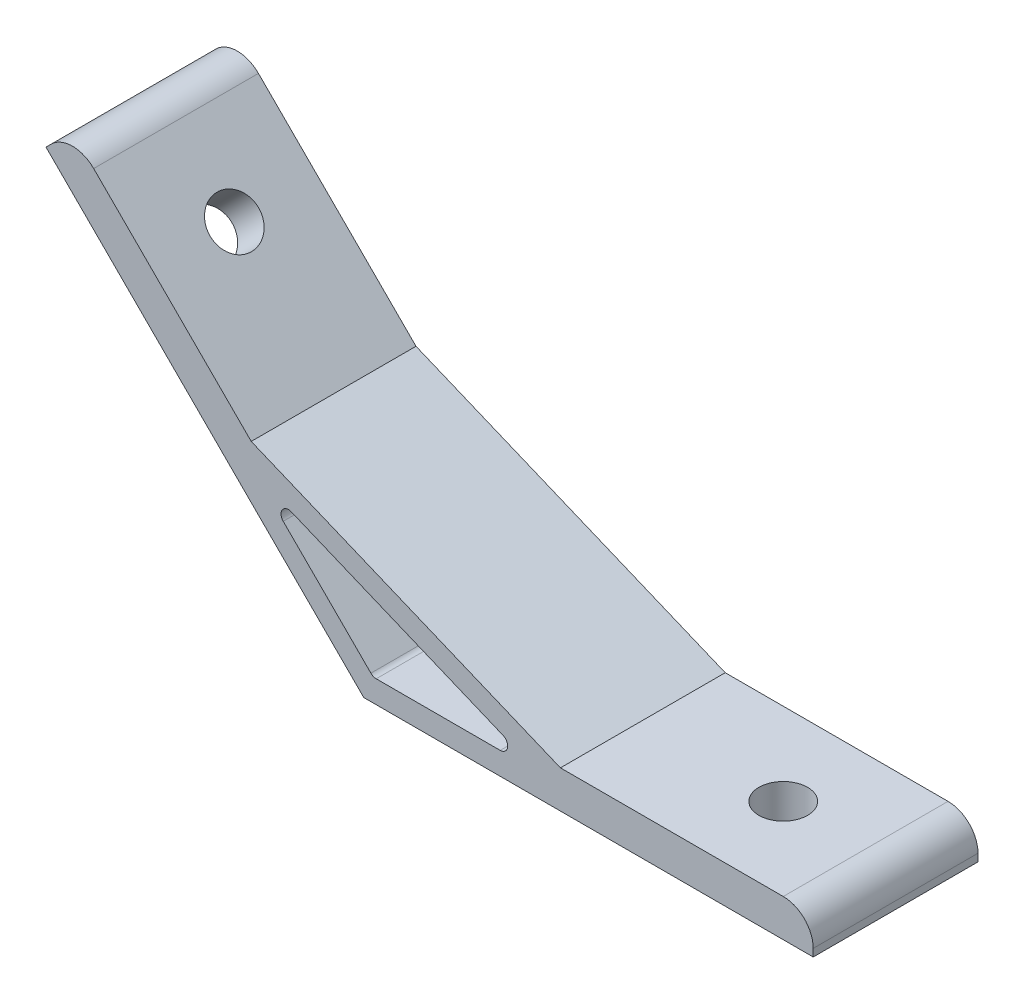
ISO-10303-21;
HEADER;
FILE_DESCRIPTION(('STEP AP214'),'2;1');
FILE_NAME('part.step','',(''),(''),'','','');
FILE_SCHEMA(('AUTOMOTIVE_DESIGN { 1 0 10303 214 1 1 1 1 }'));
ENDSEC;
DATA;
#1=APPLICATION_CONTEXT('core data for automotive mechanical design processes');
#2=APPLICATION_PROTOCOL_DEFINITION('international standard','automotive_design',2000,#1);
#3=PRODUCT_CONTEXT('',#1,'mechanical');
#4=PRODUCT('Part','Part','',(#3));
#5=PRODUCT_RELATED_PRODUCT_CATEGORY('part','',(#4));
#6=PRODUCT_DEFINITION_FORMATION('','',#4);
#7=PRODUCT_DEFINITION_CONTEXT('part definition',#1,'design');
#8=PRODUCT_DEFINITION('design','',#6,#7);
#9=PRODUCT_DEFINITION_SHAPE('','',#8);
#10=(LENGTH_UNIT() NAMED_UNIT(*) SI_UNIT(.MILLI.,.METRE.));
#11=(NAMED_UNIT(*) PLANE_ANGLE_UNIT() SI_UNIT($,.RADIAN.));
#12=(NAMED_UNIT(*) SI_UNIT($,.STERADIAN.) SOLID_ANGLE_UNIT());
#13=UNCERTAINTY_MEASURE_WITH_UNIT(LENGTH_MEASURE(1.E-05),#10,'distance_accuracy_value','');
#14=(GEOMETRIC_REPRESENTATION_CONTEXT(3) GLOBAL_UNCERTAINTY_ASSIGNED_CONTEXT((#13)) GLOBAL_UNIT_ASSIGNED_CONTEXT((#10,
#11,#12)) REPRESENTATION_CONTEXT('',''));
#15=CARTESIAN_POINT('',(0.,0.,0.));
#16=DIRECTION('',(0.,0.,1.));
#17=DIRECTION('',(1.,0.,0.));
#18=AXIS2_PLACEMENT_3D('',#15,#16,#17);
#19=CARTESIAN_POINT('',(0.,0.,11.));
#20=DIRECTION('',(0.,0.,1.));
#21=DIRECTION('',(1.,0.,0.));
#22=AXIS2_PLACEMENT_3D('',#19,#20,#21);
#23=PLANE('',#22);
#24=DIRECTION('',(0.,1.,0.));
#25=VECTOR('',#24,1.);
#26=CARTESIAN_POINT('',(60.,5.,11.));
#27=LINE('',#26,#25);
#28=CARTESIAN_POINT('',(60.,0.,11.));
#29=VERTEX_POINT('',#28);
#30=CARTESIAN_POINT('',(60.,1.,11.));
#31=VERTEX_POINT('',#30);
#32=EDGE_CURVE('E142',#29,#31,#27,.T.);
#33=ORIENTED_EDGE('',*,*,#32,.T.);
#34=CARTESIAN_POINT('',(56.,1.,11.));
#35=DIRECTION('',(0.,0.,1.));
#36=DIRECTION('',(1.,0.,0.));
#37=AXIS2_PLACEMENT_3D('',#34,#35,#36);
#38=CIRCLE('',#37,4.);
#39=CARTESIAN_POINT('',(56.,5.,11.));
#40=VERTEX_POINT('',#39);
#41=EDGE_CURVE('E184',#31,#40,#38,.T.);
#42=ORIENTED_EDGE('',*,*,#41,.T.);
#43=DIRECTION('',(-1.,0.,0.));
#44=VECTOR('',#43,1.);
#45=CARTESIAN_POINT('',(26.2535913516314,5.,11.));
#46=LINE('',#45,#44);
#47=CARTESIAN_POINT('',(26.2535913516314,5.,11.));
#48=VERTEX_POINT('',#47);
#49=EDGE_CURVE('E153',#40,#48,#46,.T.);
#50=ORIENTED_EDGE('',*,*,#49,.T.);
#51=DIRECTION('',(-0.923879532511286,0.382683432365091,0.));
#52=VECTOR('',#51,1.);
#53=CARTESIAN_POINT('',(-15.0285585693062,22.0996263811718,11.));
#54=LINE('',#53,#52);
#55=CARTESIAN_POINT('',(-15.0285585693062,22.0996263811718,11.));
#56=VERTEX_POINT('',#55);
#57=EDGE_CURVE('E244',#48,#56,#54,.T.);
#58=ORIENTED_EDGE('',*,*,#57,.T.);
#59=DIRECTION('',(-0.707106781186546,0.707106781186549,0.));
#60=VECTOR('',#59,1.);
#61=CARTESIAN_POINT('',(-38.89087296526,45.9619407771256,11.));
#62=LINE('',#61,#60);
#63=CARTESIAN_POINT('',(-36.0624458405138,43.1335136523795,11.));
#64=VERTEX_POINT('',#63);
#65=EDGE_CURVE('E246',#56,#64,#62,.T.);
#66=ORIENTED_EDGE('',*,*,#65,.T.);
#67=CARTESIAN_POINT('',(-38.89087296526,40.3050865276333,11.));
#68=DIRECTION('',(0.,0.,1.));
#69=DIRECTION('',(1.,0.,0.));
#70=AXIS2_PLACEMENT_3D('',#67,#68,#69);
#71=CIRCLE('',#70,4.);
#72=CARTESIAN_POINT('',(-41.7193000900062,43.1335136523795,11.));
#73=VERTEX_POINT('',#72);
#74=EDGE_CURVE('E182',#64,#73,#71,.T.);
#75=ORIENTED_EDGE('',*,*,#74,.T.);
#76=DIRECTION('',(-0.707106781186549,-0.707106781186546,0.));
#77=VECTOR('',#76,1.);
#78=CARTESIAN_POINT('',(-42.4264068711928,42.4264068711929,11.));
#79=LINE('',#78,#77);
#80=CARTESIAN_POINT('',(-42.4264068711928,42.4264068711929,11.));
#81=VERTEX_POINT('',#80);
#82=EDGE_CURVE('E249',#73,#81,#79,.T.);
#83=ORIENTED_EDGE('',*,*,#82,.T.);
#84=DIRECTION('',(0.707106781186546,-0.707106781186549,0.));
#85=VECTOR('',#84,1.);
#86=CARTESIAN_POINT('',(0.,0.,11.));
#87=LINE('',#86,#85);
#88=CARTESIAN_POINT('',(0.,0.,11.));
#89=VERTEX_POINT('',#88);
#90=EDGE_CURVE('E158',#81,#89,#87,.T.);
#91=ORIENTED_EDGE('',*,*,#90,.T.);
#92=DIRECTION('',(1.,0.,0.));
#93=VECTOR('',#92,1.);
#94=CARTESIAN_POINT('',(60.,0.,11.));
#95=LINE('',#94,#93);
#96=EDGE_CURVE('E154',#89,#29,#95,.T.);
#97=ORIENTED_EDGE('',*,*,#96,.T.);
#98=EDGE_LOOP('',(#33,#42,#50,#58,#66,#75,#83,#91,#97));
#99=FACE_BOUND('',#98,.T.);
#100=DIRECTION('',(1.,0.,0.));
#101=VECTOR('',#100,1.);
#102=CARTESIAN_POINT('',(23.2426406871193,3.,11.));
#103=LINE('',#102,#101);
#104=CARTESIAN_POINT('',(1.65685424949238,3.,11.));
#105=VERTEX_POINT('',#104);
#106=CARTESIAN_POINT('',(18.2153011949934,3.,11.));
#107=VERTEX_POINT('',#106);
#108=EDGE_CURVE('E229',#105,#107,#103,.T.);
#109=ORIENTED_EDGE('',*,*,#108,.F.);
#110=CARTESIAN_POINT('',(1.65685424949239,4.,11.));
#111=DIRECTION('',(0.,0.,1.));
#112=DIRECTION('',(1.,0.,0.));
#113=AXIS2_PLACEMENT_3D('',#110,#111,#112);
#114=CIRCLE('',#113,1.);
#115=CARTESIAN_POINT('',(0.949747468305837,3.29289321881345,11.));
#116=VERTEX_POINT('',#115);
#117=EDGE_CURVE('E211',#105,#116,#114,.F.);
#118=ORIENTED_EDGE('',*,*,#117,.T.);
#119=DIRECTION('',(0.707106781186546,-0.707106781186549,0.));
#120=VECTOR('',#119,1.);
#121=CARTESIAN_POINT('',(1.24264068711929,3.,11.));
#122=LINE('',#121,#120);
#123=CARTESIAN_POINT('',(-10.7588426527756,15.001483339895,11.));
#124=VERTEX_POINT('',#123);
#125=EDGE_CURVE('E226',#124,#116,#122,.T.);
#126=ORIENTED_EDGE('',*,*,#125,.F.);
#127=CARTESIAN_POINT('',(-10.0517358715891,15.7085901210815,11.));
#128=DIRECTION('',(0.,0.,1.));
#129=DIRECTION('',(1.,0.,0.));
#130=AXIS2_PLACEMENT_3D('',#127,#128,#129);
#131=CIRCLE('',#130,1.);
#132=CARTESIAN_POINT('',(-9.66905243922398,16.6324696535928,11.));
#133=VERTEX_POINT('',#132);
#134=EDGE_CURVE('E207',#124,#133,#131,.F.);
#135=ORIENTED_EDGE('',*,*,#134,.T.);
#136=DIRECTION('',(-0.923879532511286,0.382683432365091,0.));
#137=VECTOR('',#136,1.);
#138=CARTESIAN_POINT('',(-14.3137084989847,18.5563491861041,11.));
#139=LINE('',#138,#137);
#140=CARTESIAN_POINT('',(18.5979846273585,4.92387953251129,11.));
#141=VERTEX_POINT('',#140);
#142=EDGE_CURVE('E231',#141,#133,#139,.T.);
#143=ORIENTED_EDGE('',*,*,#142,.F.);
#144=CARTESIAN_POINT('',(18.2153011949934,4.,11.));
#145=DIRECTION('',(0.,0.,1.));
#146=DIRECTION('',(1.,0.,0.));
#147=AXIS2_PLACEMENT_3D('',#144,#145,#146);
#148=CIRCLE('',#147,1.);
#149=EDGE_CURVE('E11',#141,#107,#148,.F.);
#150=ORIENTED_EDGE('',*,*,#149,.T.);
#151=EDGE_LOOP('',(#109,#118,#126,#135,#143,#150));
#152=FACE_BOUND('',#151,.T.);
#153=ADVANCED_FACE('F35',(#99,#152),#23,.T.);
#154=CARTESIAN_POINT('',(0.,0.,-11.));
#155=DIRECTION('',(0.,0.,1.));
#156=DIRECTION('',(1.,0.,0.));
#157=AXIS2_PLACEMENT_3D('',#154,#155,#156);
#158=PLANE('',#157);
#159=DIRECTION('',(-1.,0.,0.));
#160=VECTOR('',#159,1.);
#161=CARTESIAN_POINT('',(26.2535913516314,5.,-11.));
#162=LINE('',#161,#160);
#163=CARTESIAN_POINT('',(56.,5.,-11.));
#164=VERTEX_POINT('',#163);
#165=CARTESIAN_POINT('',(26.2535913516314,5.,-11.));
#166=VERTEX_POINT('',#165);
#167=EDGE_CURVE('E256',#164,#166,#162,.T.);
#168=ORIENTED_EDGE('',*,*,#167,.F.);
#169=CARTESIAN_POINT('',(56.,1.,-11.));
#170=DIRECTION('',(0.,0.,1.));
#171=DIRECTION('',(1.,0.,0.));
#172=AXIS2_PLACEMENT_3D('',#169,#170,#171);
#173=CIRCLE('',#172,4.);
#174=CARTESIAN_POINT('',(60.,1.,-11.));
#175=VERTEX_POINT('',#174);
#176=EDGE_CURVE('E179',#164,#175,#173,.F.);
#177=ORIENTED_EDGE('',*,*,#176,.T.);
#178=DIRECTION('',(0.,1.,0.));
#179=VECTOR('',#178,1.);
#180=CARTESIAN_POINT('',(60.,5.,-11.));
#181=LINE('',#180,#179);
#182=CARTESIAN_POINT('',(60.,0.,-11.));
#183=VERTEX_POINT('',#182);
#184=EDGE_CURVE('E254',#183,#175,#181,.T.);
#185=ORIENTED_EDGE('',*,*,#184,.F.);
#186=DIRECTION('',(1.,0.,0.));
#187=VECTOR('',#186,1.);
#188=CARTESIAN_POINT('',(60.,0.,-11.));
#189=LINE('',#188,#187);
#190=CARTESIAN_POINT('',(0.,0.,-11.));
#191=VERTEX_POINT('',#190);
#192=EDGE_CURVE('E166',#191,#183,#189,.T.);
#193=ORIENTED_EDGE('',*,*,#192,.F.);
#194=DIRECTION('',(0.707106781186546,-0.707106781186549,0.));
#195=VECTOR('',#194,1.);
#196=CARTESIAN_POINT('',(0.,0.,-11.));
#197=LINE('',#196,#195);
#198=CARTESIAN_POINT('',(-42.4264068711928,42.4264068711929,-11.));
#199=VERTEX_POINT('',#198);
#200=EDGE_CURVE('E162',#199,#191,#197,.T.);
#201=ORIENTED_EDGE('',*,*,#200,.F.);
#202=DIRECTION('',(-0.707106781186549,-0.707106781186546,0.));
#203=VECTOR('',#202,1.);
#204=CARTESIAN_POINT('',(-42.4264068711928,42.4264068711929,-11.));
#205=LINE('',#204,#203);
#206=CARTESIAN_POINT('',(-41.7193000900062,43.1335136523795,-11.));
#207=VERTEX_POINT('',#206);
#208=EDGE_CURVE('E263',#207,#199,#205,.T.);
#209=ORIENTED_EDGE('',*,*,#208,.F.);
#210=CARTESIAN_POINT('',(-38.89087296526,40.3050865276333,-11.));
#211=DIRECTION('',(0.,0.,1.));
#212=DIRECTION('',(1.,0.,0.));
#213=AXIS2_PLACEMENT_3D('',#210,#211,#212);
#214=CIRCLE('',#213,4.);
#215=CARTESIAN_POINT('',(-36.0624458405138,43.1335136523795,-11.));
#216=VERTEX_POINT('',#215);
#217=EDGE_CURVE('E171',#207,#216,#214,.F.);
#218=ORIENTED_EDGE('',*,*,#217,.T.);
#219=DIRECTION('',(-0.707106781186546,0.707106781186549,0.));
#220=VECTOR('',#219,1.);
#221=CARTESIAN_POINT('',(-38.89087296526,45.9619407771256,-11.));
#222=LINE('',#221,#220);
#223=CARTESIAN_POINT('',(-15.0285585693062,22.0996263811718,-11.));
#224=VERTEX_POINT('',#223);
#225=EDGE_CURVE('E260',#224,#216,#222,.T.);
#226=ORIENTED_EDGE('',*,*,#225,.F.);
#227=DIRECTION('',(-0.923879532511286,0.382683432365091,0.));
#228=VECTOR('',#227,1.);
#229=CARTESIAN_POINT('',(-15.0285585693062,22.0996263811718,-11.));
#230=LINE('',#229,#228);
#231=EDGE_CURVE('E258',#166,#224,#230,.T.);
#232=ORIENTED_EDGE('',*,*,#231,.F.);
#233=EDGE_LOOP('',(#168,#177,#185,#193,#201,#209,#218,#226,#232));
#234=FACE_BOUND('',#233,.T.);
#235=DIRECTION('',(-0.923879532511286,0.382683432365091,0.));
#236=VECTOR('',#235,1.);
#237=CARTESIAN_POINT('',(-14.3137084989847,18.5563491861041,-11.));
#238=LINE('',#237,#236);
#239=CARTESIAN_POINT('',(18.5979846273585,4.92387953251129,-11.));
#240=VERTEX_POINT('',#239);
#241=CARTESIAN_POINT('',(-9.66905243922398,16.6324696535928,-11.));
#242=VERTEX_POINT('',#241);
#243=EDGE_CURVE('E217',#240,#242,#238,.T.);
#244=ORIENTED_EDGE('',*,*,#243,.T.);
#245=CARTESIAN_POINT('',(-10.0517358715891,15.7085901210815,-11.));
#246=DIRECTION('',(0.,0.,1.));
#247=DIRECTION('',(1.,0.,0.));
#248=AXIS2_PLACEMENT_3D('',#245,#246,#247);
#249=CIRCLE('',#248,1.);
#250=CARTESIAN_POINT('',(-10.7588426527756,15.001483339895,-11.));
#251=VERTEX_POINT('',#250);
#252=EDGE_CURVE('E205',#242,#251,#249,.T.);
#253=ORIENTED_EDGE('',*,*,#252,.T.);
#254=DIRECTION('',(0.707106781186546,-0.707106781186549,0.));
#255=VECTOR('',#254,1.);
#256=CARTESIAN_POINT('',(1.24264068711929,3.,-11.));
#257=LINE('',#256,#255);
#258=CARTESIAN_POINT('',(0.949747468305837,3.29289321881345,-11.));
#259=VERTEX_POINT('',#258);
#260=EDGE_CURVE('E238',#251,#259,#257,.T.);
#261=ORIENTED_EDGE('',*,*,#260,.T.);
#262=CARTESIAN_POINT('',(1.65685424949239,4.,-11.));
#263=DIRECTION('',(0.,0.,1.));
#264=DIRECTION('',(1.,0.,0.));
#265=AXIS2_PLACEMENT_3D('',#262,#263,#264);
#266=CIRCLE('',#265,1.);
#267=CARTESIAN_POINT('',(1.65685424949238,3.,-11.));
#268=VERTEX_POINT('',#267);
#269=EDGE_CURVE('E209',#259,#268,#266,.T.);
#270=ORIENTED_EDGE('',*,*,#269,.T.);
#271=DIRECTION('',(1.,0.,0.));
#272=VECTOR('',#271,1.);
#273=CARTESIAN_POINT('',(23.2426406871193,3.,-11.));
#274=LINE('',#273,#272);
#275=CARTESIAN_POINT('',(18.2153011949934,3.,-11.));
#276=VERTEX_POINT('',#275);
#277=EDGE_CURVE('E218',#268,#276,#274,.T.);
#278=ORIENTED_EDGE('',*,*,#277,.T.);
#279=CARTESIAN_POINT('',(18.2153011949934,4.,-11.));
#280=DIRECTION('',(0.,0.,1.));
#281=DIRECTION('',(1.,0.,0.));
#282=AXIS2_PLACEMENT_3D('',#279,#280,#281);
#283=CIRCLE('',#282,1.);
#284=EDGE_CURVE('E43',#276,#240,#283,.T.);
#285=ORIENTED_EDGE('',*,*,#284,.T.);
#286=EDGE_LOOP('',(#244,#253,#261,#270,#278,#285));
#287=FACE_BOUND('',#286,.T.);
#288=ADVANCED_FACE('F216',(#234,#287),#158,.F.);
#289=CARTESIAN_POINT('',(60.,0.,11.));
#290=DIRECTION('',(0.,1.,0.));
#291=DIRECTION('',(0.,0.,1.));
#292=AXIS2_PLACEMENT_3D('',#289,#290,#291);
#293=PLANE('',#292);
#294=CARTESIAN_POINT('',(45.,0.,0.));
#295=DIRECTION('',(0.,-1.,0.));
#296=DIRECTION('',(0.,0.,-1.));
#297=AXIS2_PLACEMENT_3D('',#294,#295,#296);
#298=CIRCLE('',#297,3.25);
#299=CARTESIAN_POINT('',(45.,0.,-3.25));
#300=VERTEX_POINT('',#299);
#301=EDGE_CURVE('E343',#300,#300,#298,.T.);
#302=ORIENTED_EDGE('',*,*,#301,.F.);
#303=EDGE_LOOP('',(#302));
#304=FACE_BOUND('',#303,.T.);
#305=ORIENTED_EDGE('',*,*,#192,.T.);
#306=DIRECTION('',(0.,0.,-1.));
#307=VECTOR('',#306,1.);
#308=CARTESIAN_POINT('',(60.,0.,11.));
#309=LINE('',#308,#307);
#310=EDGE_CURVE('E147',#29,#183,#309,.T.);
#311=ORIENTED_EDGE('',*,*,#310,.F.);
#312=ORIENTED_EDGE('',*,*,#96,.F.);
#313=DIRECTION('',(0.,0.,-1.));
#314=VECTOR('',#313,1.);
#315=CARTESIAN_POINT('',(0.,0.,11.));
#316=LINE('',#315,#314);
#317=EDGE_CURVE('E252',#89,#191,#316,.T.);
#318=ORIENTED_EDGE('',*,*,#317,.T.);
#319=EDGE_LOOP('',(#305,#311,#312,#318));
#320=FACE_BOUND('',#319,.T.);
#321=ADVANCED_FACE('F164',(#304,#320),#293,.F.);
#322=CARTESIAN_POINT('',(60.,5.,11.));
#323=DIRECTION('',(-1.,0.,0.));
#324=DIRECTION('',(0.,0.,1.));
#325=AXIS2_PLACEMENT_3D('',#322,#323,#324);
#326=PLANE('',#325);
#327=ORIENTED_EDGE('',*,*,#184,.T.);
#328=DIRECTION('',(0.,0.,-1.));
#329=VECTOR('',#328,1.);
#330=CARTESIAN_POINT('',(60.,1.,11.));
#331=LINE('',#330,#329);
#332=EDGE_CURVE('E150',#175,#31,#331,.F.);
#333=ORIENTED_EDGE('',*,*,#332,.T.);
#334=ORIENTED_EDGE('',*,*,#32,.F.);
#335=ORIENTED_EDGE('',*,*,#310,.T.);
#336=EDGE_LOOP('',(#327,#333,#334,#335));
#337=FACE_BOUND('',#336,.T.);
#338=ADVANCED_FACE('F145',(#337),#326,.F.);
#339=CARTESIAN_POINT('',(26.2535913516314,5.,11.));
#340=DIRECTION('',(0.,-1.,0.));
#341=DIRECTION('',(0.,0.,-1.));
#342=AXIS2_PLACEMENT_3D('',#339,#340,#341);
#343=PLANE('',#342);
#344=CARTESIAN_POINT('',(45.,5.,0.));
#345=DIRECTION('',(0.,-1.,0.));
#346=DIRECTION('',(0.,0.,-1.));
#347=AXIS2_PLACEMENT_3D('',#344,#345,#346);
#348=CIRCLE('',#347,3.25);
#349=CARTESIAN_POINT('',(45.,5.,-3.25));
#350=VERTEX_POINT('',#349);
#351=EDGE_CURVE('E345',#350,#350,#348,.F.);
#352=ORIENTED_EDGE('',*,*,#351,.F.);
#353=EDGE_LOOP('',(#352));
#354=FACE_BOUND('',#353,.T.);
#355=ORIENTED_EDGE('',*,*,#49,.F.);
#356=DIRECTION('',(0.,0.,-1.));
#357=VECTOR('',#356,1.);
#358=CARTESIAN_POINT('',(56.,5.,11.));
#359=LINE('',#358,#357);
#360=EDGE_CURVE('E167',#40,#164,#359,.T.);
#361=ORIENTED_EDGE('',*,*,#360,.T.);
#362=ORIENTED_EDGE('',*,*,#167,.T.);
#363=DIRECTION('',(0.,0.,-1.));
#364=VECTOR('',#363,1.);
#365=CARTESIAN_POINT('',(26.2535913516314,5.,11.));
#366=LINE('',#365,#364);
#367=EDGE_CURVE('E168',#48,#166,#366,.T.);
#368=ORIENTED_EDGE('',*,*,#367,.F.);
#369=EDGE_LOOP('',(#355,#361,#362,#368));
#370=FACE_BOUND('',#369,.T.);
#371=ADVANCED_FACE('F295',(#354,#370),#343,.F.);
#372=CARTESIAN_POINT('',(-15.0285585693062,22.0996263811718,11.));
#373=DIRECTION('',(-0.382683432365091,-0.923879532511287,0.));
#374=DIRECTION('',(0.923879532511287,-0.382683432365091,0.));
#375=AXIS2_PLACEMENT_3D('',#372,#373,#374);
#376=PLANE('',#375);
#377=ORIENTED_EDGE('',*,*,#231,.T.);
#378=DIRECTION('',(0.,0.,-1.));
#379=VECTOR('',#378,1.);
#380=CARTESIAN_POINT('',(-15.0285585693062,22.0996263811718,11.));
#381=LINE('',#380,#379);
#382=EDGE_CURVE('E174',#56,#224,#381,.T.);
#383=ORIENTED_EDGE('',*,*,#382,.F.);
#384=ORIENTED_EDGE('',*,*,#57,.F.);
#385=ORIENTED_EDGE('',*,*,#367,.T.);
#386=EDGE_LOOP('',(#377,#383,#384,#385));
#387=FACE_BOUND('',#386,.T.);
#388=ADVANCED_FACE('F293',(#387),#376,.F.);
#389=CARTESIAN_POINT('',(-38.89087296526,45.9619407771256,11.));
#390=DIRECTION('',(-0.707106781186549,-0.707106781186546,0.));
#391=DIRECTION('',(0.707106781186546,-0.707106781186549,0.));
#392=AXIS2_PLACEMENT_3D('',#389,#390,#391);
#393=PLANE('',#392);
#394=CARTESIAN_POINT('',(-28.2842712474618,35.3553390593274,0.));
#395=DIRECTION('',(-0.707106781186549,-0.707106781186546,0.));
#396=DIRECTION('',(0.707106781186546,-0.707106781186549,0.));
#397=AXIS2_PLACEMENT_3D('',#394,#395,#396);
#398=CIRCLE('',#397,3.25);
#399=CARTESIAN_POINT('',(-25.9861742086056,33.0572420204711,0.));
#400=VERTEX_POINT('',#399);
#401=EDGE_CURVE('E241',#400,#400,#398,.F.);
#402=ORIENTED_EDGE('',*,*,#401,.F.);
#403=EDGE_LOOP('',(#402));
#404=FACE_BOUND('',#403,.T.);
#405=ORIENTED_EDGE('',*,*,#225,.T.);
#406=DIRECTION('',(0.,0.,-1.));
#407=VECTOR('',#406,1.);
#408=CARTESIAN_POINT('',(-36.0624458405138,43.1335136523795,11.));
#409=LINE('',#408,#407);
#410=EDGE_CURVE('E189',#216,#64,#409,.F.);
#411=ORIENTED_EDGE('',*,*,#410,.T.);
#412=ORIENTED_EDGE('',*,*,#65,.F.);
#413=ORIENTED_EDGE('',*,*,#382,.T.);
#414=EDGE_LOOP('',(#405,#411,#412,#413));
#415=FACE_BOUND('',#414,.T.);
#416=ADVANCED_FACE('F274',(#404,#415),#393,.F.);
#417=CARTESIAN_POINT('',(-42.4264068711928,42.4264068711929,11.));
#418=DIRECTION('',(0.707106781186546,-0.707106781186549,0.));
#419=DIRECTION('',(0.707106781186549,0.707106781186546,0.));
#420=AXIS2_PLACEMENT_3D('',#417,#418,#419);
#421=PLANE('',#420);
#422=ORIENTED_EDGE('',*,*,#82,.F.);
#423=DIRECTION('',(0.,0.,-1.));
#424=VECTOR('',#423,1.);
#425=CARTESIAN_POINT('',(-41.7193000900062,43.1335136523795,11.));
#426=LINE('',#425,#424);
#427=EDGE_CURVE('E186',#73,#207,#426,.T.);
#428=ORIENTED_EDGE('',*,*,#427,.T.);
#429=ORIENTED_EDGE('',*,*,#208,.T.);
#430=DIRECTION('',(0.,0.,-1.));
#431=VECTOR('',#430,1.);
#432=CARTESIAN_POINT('',(-42.4264068711928,42.4264068711929,11.));
#433=LINE('',#432,#431);
#434=EDGE_CURVE('E267',#81,#199,#433,.T.);
#435=ORIENTED_EDGE('',*,*,#434,.F.);
#436=EDGE_LOOP('',(#422,#428,#429,#435));
#437=FACE_BOUND('',#436,.T.);
#438=ADVANCED_FACE('F289',(#437),#421,.F.);
#439=CARTESIAN_POINT('',(0.,0.,11.));
#440=DIRECTION('',(0.707106781186549,0.707106781186546,0.));
#441=DIRECTION('',(-0.707106781186546,0.707106781186549,0.));
#442=AXIS2_PLACEMENT_3D('',#439,#440,#441);
#443=PLANE('',#442);
#444=CARTESIAN_POINT('',(-31.8198051533946,31.8198051533947,0.));
#445=DIRECTION('',(-0.707106781186549,-0.707106781186546,0.));
#446=DIRECTION('',(0.707106781186546,-0.707106781186549,0.));
#447=AXIS2_PLACEMENT_3D('',#444,#445,#446);
#448=CIRCLE('',#447,3.25);
#449=CARTESIAN_POINT('',(-29.5217081145383,29.5217081145384,0.));
#450=VERTEX_POINT('',#449);
#451=EDGE_CURVE('E348',#450,#450,#448,.T.);
#452=ORIENTED_EDGE('',*,*,#451,.F.);
#453=EDGE_LOOP('',(#452));
#454=FACE_BOUND('',#453,.T.);
#455=ORIENTED_EDGE('',*,*,#200,.T.);
#456=ORIENTED_EDGE('',*,*,#317,.F.);
#457=ORIENTED_EDGE('',*,*,#90,.F.);
#458=ORIENTED_EDGE('',*,*,#434,.T.);
#459=EDGE_LOOP('',(#455,#456,#457,#458));
#460=FACE_BOUND('',#459,.T.);
#461=ADVANCED_FACE('F322',(#454,#460),#443,.F.);
#462=CARTESIAN_POINT('',(1.24264068711929,3.,11.));
#463=DIRECTION('',(0.707106781186549,0.707106781186546,0.));
#464=DIRECTION('',(-0.707106781186546,0.707106781186549,0.));
#465=AXIS2_PLACEMENT_3D('',#462,#463,#464);
#466=PLANE('',#465);
#467=ORIENTED_EDGE('',*,*,#260,.F.);
#468=DIRECTION('',(0.,0.,-1.));
#469=VECTOR('',#468,1.);
#470=CARTESIAN_POINT('',(-10.7588426527756,15.001483339895,11.));
#471=LINE('',#470,#469);
#472=EDGE_CURVE('E199',#251,#124,#471,.F.);
#473=ORIENTED_EDGE('',*,*,#472,.T.);
#474=ORIENTED_EDGE('',*,*,#125,.T.);
#475=DIRECTION('',(0.,0.,-1.));
#476=VECTOR('',#475,1.);
#477=CARTESIAN_POINT('',(0.949747468305837,3.29289321881345,-11.));
#478=LINE('',#477,#476);
#479=EDGE_CURVE('E196',#116,#259,#478,.T.);
#480=ORIENTED_EDGE('',*,*,#479,.T.);
#481=EDGE_LOOP('',(#467,#473,#474,#480));
#482=FACE_BOUND('',#481,.T.);
#483=ADVANCED_FACE('F319',(#482),#466,.T.);
#484=CARTESIAN_POINT('',(23.2426406871193,3.,11.));
#485=DIRECTION('',(0.,1.,0.));
#486=DIRECTION('',(0.,0.,1.));
#487=AXIS2_PLACEMENT_3D('',#484,#485,#486);
#488=PLANE('',#487);
#489=ORIENTED_EDGE('',*,*,#277,.F.);
#490=DIRECTION('',(0.,0.,-1.));
#491=VECTOR('',#490,1.);
#492=CARTESIAN_POINT('',(1.65685424949239,3.,11.));
#493=LINE('',#492,#491);
#494=EDGE_CURVE('E55',#268,#105,#493,.F.);
#495=ORIENTED_EDGE('',*,*,#494,.T.);
#496=ORIENTED_EDGE('',*,*,#108,.T.);
#497=DIRECTION('',(0.,0.,-1.));
#498=VECTOR('',#497,1.);
#499=CARTESIAN_POINT('',(18.2153011949934,3.,-11.));
#500=LINE('',#499,#498);
#501=EDGE_CURVE('E201',#107,#276,#500,.T.);
#502=ORIENTED_EDGE('',*,*,#501,.T.);
#503=EDGE_LOOP('',(#489,#495,#496,#502));
#504=FACE_BOUND('',#503,.T.);
#505=ADVANCED_FACE('F228',(#504),#488,.T.);
#506=CARTESIAN_POINT('',(-14.3137084989847,18.5563491861041,11.));
#507=DIRECTION('',(-0.382683432365091,-0.923879532511287,0.));
#508=DIRECTION('',(0.923879532511287,-0.382683432365091,0.));
#509=AXIS2_PLACEMENT_3D('',#506,#507,#508);
#510=PLANE('',#509);
#511=ORIENTED_EDGE('',*,*,#142,.T.);
#512=DIRECTION('',(0.,0.,-1.));
#513=VECTOR('',#512,1.);
#514=CARTESIAN_POINT('',(-9.66905243922398,16.6324696535928,-11.));
#515=LINE('',#514,#513);
#516=EDGE_CURVE('E193',#133,#242,#515,.T.);
#517=ORIENTED_EDGE('',*,*,#516,.T.);
#518=ORIENTED_EDGE('',*,*,#243,.F.);
#519=DIRECTION('',(0.,0.,-1.));
#520=VECTOR('',#519,1.);
#521=CARTESIAN_POINT('',(18.5979846273585,4.92387953251129,11.));
#522=LINE('',#521,#520);
#523=EDGE_CURVE('E191',#240,#141,#522,.F.);
#524=ORIENTED_EDGE('',*,*,#523,.T.);
#525=EDGE_LOOP('',(#511,#517,#518,#524));
#526=FACE_BOUND('',#525,.T.);
#527=ADVANCED_FACE('F224',(#526),#510,.T.);
#528=CARTESIAN_POINT('',(-21.7842712474618,41.8553390593274,0.));
#529=DIRECTION('',(-0.707106781186549,-0.707106781186546,0.));
#530=DIRECTION('',(0.707106781186546,-0.707106781186549,0.));
#531=AXIS2_PLACEMENT_3D('',#528,#529,#530);
#532=CYLINDRICAL_SURFACE('',#531,3.25);
#533=ORIENTED_EDGE('',*,*,#401,.T.);
#534=EDGE_LOOP('',(#533));
#535=FACE_BOUND('',#534,.T.);
#536=ORIENTED_EDGE('',*,*,#451,.T.);
#537=EDGE_LOOP('',(#536));
#538=FACE_BOUND('',#537,.T.);
#539=ADVANCED_FACE('F308',(#535,#538),#532,.F.);
#540=CARTESIAN_POINT('',(45.,14.1923881554251,0.));
#541=DIRECTION('',(0.,-1.,0.));
#542=DIRECTION('',(0.,0.,-1.));
#543=AXIS2_PLACEMENT_3D('',#540,#541,#542);
#544=CYLINDRICAL_SURFACE('',#543,3.25);
#545=ORIENTED_EDGE('',*,*,#351,.T.);
#546=EDGE_LOOP('',(#545));
#547=FACE_BOUND('',#546,.T.);
#548=ORIENTED_EDGE('',*,*,#301,.T.);
#549=EDGE_LOOP('',(#548));
#550=FACE_BOUND('',#549,.T.);
#551=ADVANCED_FACE('F300',(#547,#550),#544,.F.);
#552=CARTESIAN_POINT('',(56.,1.,11.));
#553=DIRECTION('',(0.,0.,-1.));
#554=DIRECTION('',(-1.,0.,0.));
#555=AXIS2_PLACEMENT_3D('',#552,#553,#554);
#556=CYLINDRICAL_SURFACE('',#555,4.);
#557=ORIENTED_EDGE('',*,*,#41,.F.);
#558=ORIENTED_EDGE('',*,*,#332,.F.);
#559=ORIENTED_EDGE('',*,*,#176,.F.);
#560=ORIENTED_EDGE('',*,*,#360,.F.);
#561=EDGE_LOOP('',(#557,#558,#559,#560));
#562=FACE_BOUND('',#561,.T.);
#563=ADVANCED_FACE('F298',(#562),#556,.T.);
#564=CARTESIAN_POINT('',(-38.89087296526,40.3050865276333,11.));
#565=DIRECTION('',(0.,0.,-1.));
#566=DIRECTION('',(-1.,0.,0.));
#567=AXIS2_PLACEMENT_3D('',#564,#565,#566);
#568=CYLINDRICAL_SURFACE('',#567,4.);
#569=ORIENTED_EDGE('',*,*,#74,.F.);
#570=ORIENTED_EDGE('',*,*,#410,.F.);
#571=ORIENTED_EDGE('',*,*,#217,.F.);
#572=ORIENTED_EDGE('',*,*,#427,.F.);
#573=EDGE_LOOP('',(#569,#570,#571,#572));
#574=FACE_BOUND('',#573,.T.);
#575=ADVANCED_FACE('F286',(#574),#568,.T.);
#576=CARTESIAN_POINT('',(-10.0517358715891,15.7085901210815,11.));
#577=DIRECTION('',(0.,0.,1.));
#578=DIRECTION('',(1.,0.,0.));
#579=AXIS2_PLACEMENT_3D('',#576,#577,#578);
#580=CYLINDRICAL_SURFACE('',#579,1.);
#581=ORIENTED_EDGE('',*,*,#134,.F.);
#582=ORIENTED_EDGE('',*,*,#472,.F.);
#583=ORIENTED_EDGE('',*,*,#252,.F.);
#584=ORIENTED_EDGE('',*,*,#516,.F.);
#585=EDGE_LOOP('',(#581,#582,#583,#584));
#586=FACE_BOUND('',#585,.T.);
#587=ADVANCED_FACE('F306',(#586),#580,.F.);
#588=CARTESIAN_POINT('',(1.65685424949239,4.,11.));
#589=DIRECTION('',(0.,0.,1.));
#590=DIRECTION('',(1.,0.,0.));
#591=AXIS2_PLACEMENT_3D('',#588,#589,#590);
#592=CYLINDRICAL_SURFACE('',#591,1.);
#593=ORIENTED_EDGE('',*,*,#117,.F.);
#594=ORIENTED_EDGE('',*,*,#494,.F.);
#595=ORIENTED_EDGE('',*,*,#269,.F.);
#596=ORIENTED_EDGE('',*,*,#479,.F.);
#597=EDGE_LOOP('',(#593,#594,#595,#596));
#598=FACE_BOUND('',#597,.T.);
#599=ADVANCED_FACE('F378',(#598),#592,.F.);
#600=CARTESIAN_POINT('',(18.2153011949934,4.,11.));
#601=DIRECTION('',(0.,0.,1.));
#602=DIRECTION('',(1.,0.,0.));
#603=AXIS2_PLACEMENT_3D('',#600,#601,#602);
#604=CYLINDRICAL_SURFACE('',#603,1.);
#605=ORIENTED_EDGE('',*,*,#149,.F.);
#606=ORIENTED_EDGE('',*,*,#523,.F.);
#607=ORIENTED_EDGE('',*,*,#284,.F.);
#608=ORIENTED_EDGE('',*,*,#501,.F.);
#609=EDGE_LOOP('',(#605,#606,#607,#608));
#610=FACE_BOUND('',#609,.T.);
#611=ADVANCED_FACE('F37',(#610),#604,.F.);
#612=CLOSED_SHELL('',(#153,#288,#321,#338,#371,#388,#416,#438,#461,#483,#505,#527,#539,#551,
#563,#575,#587,#599,#611));
#613=MANIFOLD_SOLID_BREP('B2',#612);
#614=ADVANCED_BREP_SHAPE_REPRESENTATION('',(#18,#613),#14);
#615=SHAPE_DEFINITION_REPRESENTATION(#9,#614);
ENDSEC;
END-ISO-10303-21;
